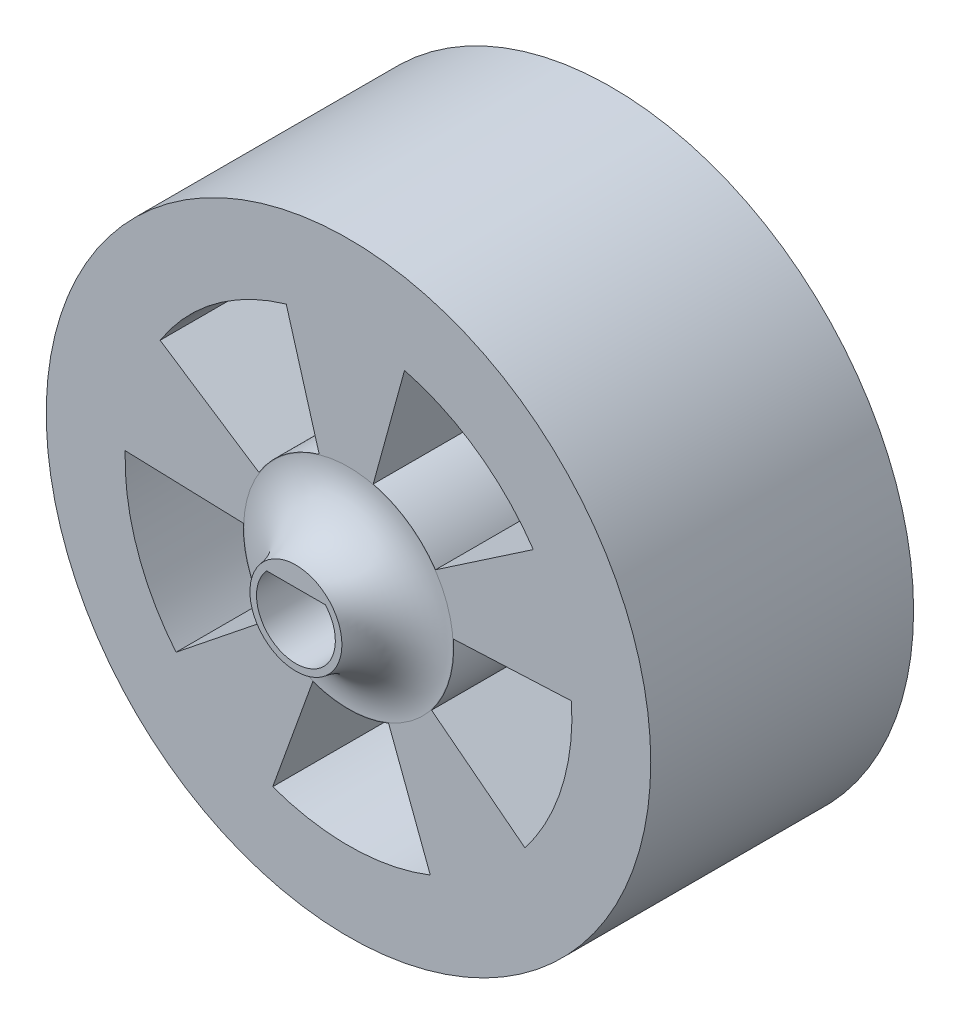
ISO-10303-21;
HEADER;
FILE_DESCRIPTION(('STEP AP214'),'2;1');
FILE_NAME('part.step','',(''),(''),'','','');
FILE_SCHEMA(('AUTOMOTIVE_DESIGN { 1 0 10303 214 1 1 1 1 }'));
ENDSEC;
DATA;
#1=APPLICATION_CONTEXT('core data for automotive mechanical design processes');
#2=APPLICATION_PROTOCOL_DEFINITION('international standard','automotive_design',2000,#1);
#3=PRODUCT_CONTEXT('',#1,'mechanical');
#4=PRODUCT('Part','Part','',(#3));
#5=PRODUCT_RELATED_PRODUCT_CATEGORY('part','',(#4));
#6=PRODUCT_DEFINITION_FORMATION('','',#4);
#7=PRODUCT_DEFINITION_CONTEXT('part definition',#1,'design');
#8=PRODUCT_DEFINITION('design','',#6,#7);
#9=PRODUCT_DEFINITION_SHAPE('','',#8);
#10=(LENGTH_UNIT() NAMED_UNIT(*) SI_UNIT(.MILLI.,.METRE.));
#11=(NAMED_UNIT(*) PLANE_ANGLE_UNIT() SI_UNIT($,.RADIAN.));
#12=(NAMED_UNIT(*) SI_UNIT($,.STERADIAN.) SOLID_ANGLE_UNIT());
#13=UNCERTAINTY_MEASURE_WITH_UNIT(LENGTH_MEASURE(1.E-05),#10,'distance_accuracy_value','');
#14=(GEOMETRIC_REPRESENTATION_CONTEXT(3) GLOBAL_UNCERTAINTY_ASSIGNED_CONTEXT((#13)) GLOBAL_UNIT_ASSIGNED_CONTEXT((#10,
#11,#12)) REPRESENTATION_CONTEXT('',''));
#15=CARTESIAN_POINT('',(0.,0.,0.));
#16=DIRECTION('',(0.,0.,1.));
#17=DIRECTION('',(1.,0.,0.));
#18=AXIS2_PLACEMENT_3D('',#15,#16,#17);
#19=CARTESIAN_POINT('',(0.,0.,0.));
#20=DIRECTION('',(0.,0.,1.));
#21=DIRECTION('',(1.,0.,0.));
#22=AXIS2_PLACEMENT_3D('',#19,#20,#21);
#23=CYLINDRICAL_SURFACE('',#22,8.5);
#24=DIRECTION('',(0.,0.,-1.));
#25=VECTOR('',#24,1.);
#26=CARTESIAN_POINT('',(8.48437143384065,0.515210027686529,10.));
#27=LINE('',#26,#25);
#28=CARTESIAN_POINT('',(8.48437143384065,0.515210027686529,10.));
#29=VERTEX_POINT('',#28);
#30=CARTESIAN_POINT('',(8.48437143384065,0.515210027686529,0.));
#31=VERTEX_POINT('',#30);
#32=EDGE_CURVE('E218',#29,#31,#27,.T.);
#33=ORIENTED_EDGE('',*,*,#32,.T.);
#34=CARTESIAN_POINT('',(0.,0.,0.));
#35=DIRECTION('',(0.,0.,1.));
#36=DIRECTION('',(1.,0.,0.));
#37=AXIS2_PLACEMENT_3D('',#34,#35,#36);
#38=CIRCLE('',#37,8.5);
#39=CARTESIAN_POINT('',(6.71424575052621,-5.21237987885963,0.));
#40=VERTEX_POINT('',#39);
#41=EDGE_CURVE('E405',#40,#31,#38,.T.);
#42=ORIENTED_EDGE('',*,*,#41,.F.);
#43=DIRECTION('',(0.,0.,-1.));
#44=VECTOR('',#43,1.);
#45=CARTESIAN_POINT('',(6.71424575052621,-5.21237987885963,10.));
#46=LINE('',#45,#44);
#47=CARTESIAN_POINT('',(6.71424575052621,-5.21237987885963,10.));
#48=VERTEX_POINT('',#47);
#49=EDGE_CURVE('E237',#48,#40,#46,.T.);
#50=ORIENTED_EDGE('',*,*,#49,.F.);
#51=CARTESIAN_POINT('',(0.,0.,10.));
#52=DIRECTION('',(0.,0.,1.));
#53=DIRECTION('',(1.,0.,0.));
#54=AXIS2_PLACEMENT_3D('',#51,#52,#53);
#55=CIRCLE('',#54,8.5);
#56=EDGE_CURVE('E420',#48,#29,#55,.T.);
#57=ORIENTED_EDGE('',*,*,#56,.T.);
#58=EDGE_LOOP('',(#33,#42,#50,#57));
#59=FACE_BOUND('',#58,.T.);
#60=ADVANCED_FACE('F33',(#59),#23,.F.);
#61=DIRECTION('',(0.,0.,-1.));
#62=VECTOR('',#61,1.);
#63=CARTESIAN_POINT('',(7.03208389051756,4.77491320933936,10.));
#64=LINE('',#63,#62);
#65=CARTESIAN_POINT('',(7.03208389051756,4.77491320933936,10.));
#66=VERTEX_POINT('',#65);
#67=CARTESIAN_POINT('',(7.03208389051755,4.77491320933936,0.));
#68=VERTEX_POINT('',#67);
#69=EDGE_CURVE('E215',#66,#68,#64,.T.);
#70=ORIENTED_EDGE('',*,*,#69,.F.);
#71=CARTESIAN_POINT('',(2.13182110555429,8.22832539305012,10.));
#72=VERTEX_POINT('',#71);
#73=EDGE_CURVE('E321',#66,#72,#55,.T.);
#74=ORIENTED_EDGE('',*,*,#73,.T.);
#75=DIRECTION('',(0.,0.,-1.));
#76=VECTOR('',#75,1.);
#77=CARTESIAN_POINT('',(2.13182110555429,8.22832539305012,10.));
#78=LINE('',#77,#76);
#79=CARTESIAN_POINT('',(2.13182110555429,8.22832539305012,0.));
#80=VERTEX_POINT('',#79);
#81=EDGE_CURVE('E315',#72,#80,#78,.T.);
#82=ORIENTED_EDGE('',*,*,#81,.T.);
#83=EDGE_CURVE('E327',#68,#80,#38,.T.);
#84=ORIENTED_EDGE('',*,*,#83,.F.);
#85=EDGE_LOOP('',(#70,#74,#82,#84));
#86=FACE_BOUND('',#85,.T.);
#87=ADVANCED_FACE('F356',(#86),#23,.F.);
#88=CARTESIAN_POINT('',(0.,0.,10.));
#89=DIRECTION('',(0.,0.,-1.));
#90=DIRECTION('',(-1.,0.,0.));
#91=AXIS2_PLACEMENT_3D('',#88,#89,#90);
#92=CYLINDRICAL_SURFACE('',#91,4.);
#93=DIRECTION('',(0.,0.,-1.));
#94=VECTOR('',#93,1.);
#95=CARTESIAN_POINT('',(3.98819234617977,0.307118559961968,10.));
#96=LINE('',#95,#94);
#97=CARTESIAN_POINT('',(3.98819234617977,0.307118559961968,10.));
#98=VERTEX_POINT('',#97);
#99=CARTESIAN_POINT('',(3.98819234617977,0.307118559961968,0.));
#100=VERTEX_POINT('',#99);
#101=EDGE_CURVE('E221',#98,#100,#96,.T.);
#102=ORIENTED_EDGE('',*,*,#101,.F.);
#103=CARTESIAN_POINT('',(0.,0.,10.));
#104=DIRECTION('',(0.,0.,1.));
#105=DIRECTION('',(1.,0.,0.));
#106=AXIS2_PLACEMENT_3D('',#103,#104,#105);
#107=CIRCLE('',#106,4.);
#108=CARTESIAN_POINT('',(3.15964505907116,-2.45288464887512,10.));
#109=VERTEX_POINT('',#108);
#110=EDGE_CURVE('E439',#109,#98,#107,.T.);
#111=ORIENTED_EDGE('',*,*,#110,.F.);
#112=DIRECTION('',(0.,0.,-1.));
#113=VECTOR('',#112,1.);
#114=CARTESIAN_POINT('',(3.15964505907116,-2.45288464887512,10.));
#115=LINE('',#114,#113);
#116=CARTESIAN_POINT('',(3.15964505907116,-2.45288464887512,0.));
#117=VERTEX_POINT('',#116);
#118=EDGE_CURVE('E231',#109,#117,#115,.T.);
#119=ORIENTED_EDGE('',*,*,#118,.T.);
#120=CARTESIAN_POINT('',(0.,0.,0.));
#121=DIRECTION('',(0.,0.,1.));
#122=DIRECTION('',(1.,0.,0.));
#123=AXIS2_PLACEMENT_3D('',#120,#121,#122);
#124=CIRCLE('',#123,4.);
#125=EDGE_CURVE('E423',#117,#100,#124,.T.);
#126=ORIENTED_EDGE('',*,*,#125,.T.);
#127=EDGE_LOOP('',(#102,#111,#119,#126));
#128=FACE_BOUND('',#127,.T.);
#129=ADVANCED_FACE('F363',(#128),#92,.T.);
#130=DIRECTION('',(0.,0.,-1.));
#131=VECTOR('',#130,1.);
#132=CARTESIAN_POINT('',(3.30921594847885,2.24701798086558,10.));
#133=LINE('',#132,#131);
#134=CARTESIAN_POINT('',(3.30921594847885,2.24701798086558,10.));
#135=VERTEX_POINT('',#134);
#136=CARTESIAN_POINT('',(3.30921594847885,2.24701798086558,0.));
#137=VERTEX_POINT('',#136);
#138=EDGE_CURVE('E209',#135,#137,#133,.T.);
#139=ORIENTED_EDGE('',*,*,#138,.T.);
#140=CARTESIAN_POINT('',(0.940332104078659,3.88790117338893,0.));
#141=VERTEX_POINT('',#140);
#142=EDGE_CURVE('E290',#137,#141,#124,.T.);
#143=ORIENTED_EDGE('',*,*,#142,.T.);
#144=DIRECTION('',(0.,0.,-1.));
#145=VECTOR('',#144,1.);
#146=CARTESIAN_POINT('',(0.940332104078659,3.88790117338893,10.));
#147=LINE('',#146,#145);
#148=CARTESIAN_POINT('',(0.940332104078659,3.88790117338893,10.));
#149=VERTEX_POINT('',#148);
#150=EDGE_CURVE('E318',#149,#141,#147,.T.);
#151=ORIENTED_EDGE('',*,*,#150,.F.);
#152=EDGE_CURVE('E296',#135,#149,#107,.T.);
#153=ORIENTED_EDGE('',*,*,#152,.F.);
#154=EDGE_LOOP('',(#139,#143,#151,#153));
#155=FACE_BOUND('',#154,.T.);
#156=ADVANCED_FACE('F385',(#155),#92,.T.);
#157=DIRECTION('',(0.,0.,-1.));
#158=VECTOR('',#157,1.);
#159=CARTESIAN_POINT('',(3.11180881373797,-7.90990808459509,10.));
#160=LINE('',#159,#158);
#161=CARTESIAN_POINT('',(3.11180881373797,-7.90990808459509,10.));
#162=VERTEX_POINT('',#161);
#163=CARTESIAN_POINT('',(3.11180881373797,-7.90990808459509,0.));
#164=VERTEX_POINT('',#163);
#165=EDGE_CURVE('E240',#162,#164,#160,.T.);
#166=ORIENTED_EDGE('',*,*,#165,.T.);
#167=CARTESIAN_POINT('',(-2.88245180787283,-7.99634113675065,0.));
#168=VERTEX_POINT('',#167);
#169=EDGE_CURVE('E397',#168,#164,#38,.T.);
#170=ORIENTED_EDGE('',*,*,#169,.F.);
#171=DIRECTION('',(0.,0.,-1.));
#172=VECTOR('',#171,1.);
#173=CARTESIAN_POINT('',(-2.88245180787283,-7.99634113675065,10.));
#174=LINE('',#173,#172);
#175=CARTESIAN_POINT('',(-2.88245180787283,-7.99634113675065,10.));
#176=VERTEX_POINT('',#175);
#177=EDGE_CURVE('E259',#176,#168,#174,.T.);
#178=ORIENTED_EDGE('',*,*,#177,.F.);
#179=EDGE_CURVE('E399',#176,#162,#55,.T.);
#180=ORIENTED_EDGE('',*,*,#179,.T.);
#181=EDGE_LOOP('',(#166,#170,#178,#180));
#182=FACE_BOUND('',#181,.T.);
#183=ADVANCED_FACE('F365',(#182),#23,.F.);
#184=DIRECTION('',(0.,0.,-1.));
#185=VECTOR('',#184,1.);
#186=CARTESIAN_POINT('',(1.52450631953265,-3.69809146475652,10.));
#187=LINE('',#186,#185);
#188=CARTESIAN_POINT('',(1.52450631953265,-3.69809146475652,10.));
#189=VERTEX_POINT('',#188);
#190=CARTESIAN_POINT('',(1.52450631953265,-3.69809146475652,0.));
#191=VERTEX_POINT('',#190);
#192=EDGE_CURVE('E243',#189,#191,#187,.T.);
#193=ORIENTED_EDGE('',*,*,#192,.F.);
#194=CARTESIAN_POINT('',(-1.35644790958722,-3.76298406435325,10.));
#195=VERTEX_POINT('',#194);
#196=EDGE_CURVE('E437',#195,#189,#107,.T.);
#197=ORIENTED_EDGE('',*,*,#196,.F.);
#198=DIRECTION('',(0.,0.,-1.));
#199=VECTOR('',#198,1.);
#200=CARTESIAN_POINT('',(-1.35644790958722,-3.76298406435325,10.));
#201=LINE('',#200,#199);
#202=CARTESIAN_POINT('',(-1.35644790958722,-3.76298406435325,0.));
#203=VERTEX_POINT('',#202);
#204=EDGE_CURVE('E253',#195,#203,#201,.T.);
#205=ORIENTED_EDGE('',*,*,#204,.T.);
#206=EDGE_CURVE('E424',#203,#191,#124,.T.);
#207=ORIENTED_EDGE('',*,*,#206,.T.);
#208=EDGE_LOOP('',(#193,#197,#205,#207));
#209=FACE_BOUND('',#208,.T.);
#210=ADVANCED_FACE('F378',(#209),#92,.T.);
#211=DIRECTION('',(0.,0.,-1.));
#212=VECTOR('',#211,1.);
#213=CARTESIAN_POINT('',(-6.56116782045911,-5.40380207185384,10.));
#214=LINE('',#213,#212);
#215=CARTESIAN_POINT('',(-6.56116782045911,-5.40380207185384,10.));
#216=VERTEX_POINT('',#215);
#217=CARTESIAN_POINT('',(-6.56116782045911,-5.40380207185384,0.));
#218=VERTEX_POINT('',#217);
#219=EDGE_CURVE('E262',#216,#218,#214,.T.);
#220=ORIENTED_EDGE('',*,*,#219,.T.);
#221=CARTESIAN_POINT('',(-8.4956989387252,0.270369270708785,0.));
#222=VERTEX_POINT('',#221);
#223=EDGE_CURVE('E326',#222,#218,#38,.T.);
#224=ORIENTED_EDGE('',*,*,#223,.F.);
#225=DIRECTION('',(0.,0.,-1.));
#226=VECTOR('',#225,1.);
#227=CARTESIAN_POINT('',(-8.4956989387252,0.270369270708786,10.));
#228=LINE('',#227,#226);
#229=CARTESIAN_POINT('',(-8.4956989387252,0.270369270708786,10.));
#230=VERTEX_POINT('',#229);
#231=EDGE_CURVE('E281',#230,#222,#228,.T.);
#232=ORIENTED_EDGE('',*,*,#231,.F.);
#233=EDGE_CURVE('E331',#230,#216,#55,.T.);
#234=ORIENTED_EDGE('',*,*,#233,.T.);
#235=EDGE_LOOP('',(#220,#224,#232,#234));
#236=FACE_BOUND('',#235,.T.);
#237=ADVANCED_FACE('F370',(#236),#23,.F.);
#238=DIRECTION('',(0.,0.,-1.));
#239=VECTOR('',#238,1.);
#240=CARTESIAN_POINT('',(-3.04599562464459,-2.59266477868737,10.));
#241=LINE('',#240,#239);
#242=CARTESIAN_POINT('',(-3.04599562464459,-2.59266477868737,10.));
#243=VERTEX_POINT('',#242);
#244=CARTESIAN_POINT('',(-3.04599562464459,-2.59266477868737,0.));
#245=VERTEX_POINT('',#244);
#246=EDGE_CURVE('E265',#243,#245,#241,.T.);
#247=ORIENTED_EDGE('',*,*,#246,.F.);
#248=CARTESIAN_POINT('',(-3.9979759711648,0.127232597980605,10.));
#249=VERTEX_POINT('',#248);
#250=EDGE_CURVE('E295',#249,#243,#107,.T.);
#251=ORIENTED_EDGE('',*,*,#250,.F.);
#252=DIRECTION('',(0.,0.,-1.));
#253=VECTOR('',#252,1.);
#254=CARTESIAN_POINT('',(-3.9979759711648,0.127232597980605,10.));
#255=LINE('',#254,#253);
#256=CARTESIAN_POINT('',(-3.9979759711648,0.127232597980605,0.));
#257=VERTEX_POINT('',#256);
#258=EDGE_CURVE('E275',#249,#257,#255,.T.);
#259=ORIENTED_EDGE('',*,*,#258,.T.);
#260=EDGE_CURVE('E299',#257,#245,#124,.T.);
#261=ORIENTED_EDGE('',*,*,#260,.T.);
#262=EDGE_LOOP('',(#247,#251,#259,#261));
#263=FACE_BOUND('',#262,.T.);
#264=ADVANCED_FACE('F368',(#263),#92,.T.);
#265=DIRECTION('',(0.,0.,-1.));
#266=VECTOR('',#265,1.);
#267=CARTESIAN_POINT('',(-7.16683353267374,4.57017473571233,10.));
#268=LINE('',#267,#266);
#269=CARTESIAN_POINT('',(-7.16683353267374,4.57017473571233,10.));
#270=VERTEX_POINT('',#269);
#271=CARTESIAN_POINT('',(-7.16683353267374,4.57017473571233,0.));
#272=VERTEX_POINT('',#271);
#273=EDGE_CURVE('E284',#270,#272,#268,.T.);
#274=ORIENTED_EDGE('',*,*,#273,.T.);
#275=CARTESIAN_POINT('',(-2.36817889444572,8.1634385355622,0.));
#276=VERTEX_POINT('',#275);
#277=EDGE_CURVE('E322',#276,#272,#38,.T.);
#278=ORIENTED_EDGE('',*,*,#277,.F.);
#279=DIRECTION('',(0.,0.,-1.));
#280=VECTOR('',#279,1.);
#281=CARTESIAN_POINT('',(-2.36817889444572,8.1634385355622,10.));
#282=LINE('',#281,#280);
#283=CARTESIAN_POINT('',(-2.36817889444572,8.1634385355622,10.));
#284=VERTEX_POINT('',#283);
#285=EDGE_CURVE('E312',#284,#276,#282,.T.);
#286=ORIENTED_EDGE('',*,*,#285,.F.);
#287=EDGE_CURVE('E328',#284,#270,#55,.T.);
#288=ORIENTED_EDGE('',*,*,#287,.T.);
#289=EDGE_LOOP('',(#274,#278,#286,#288));
#290=FACE_BOUND('',#289,.T.);
#291=ADVANCED_FACE('F359',(#290),#23,.F.);
#292=DIRECTION('',(0.,0.,-1.));
#293=VECTOR('',#292,1.);
#294=CARTESIAN_POINT('',(-3.40703514514646,2.09573651009301,10.));
#295=LINE('',#294,#293);
#296=CARTESIAN_POINT('',(-3.40703514514646,2.09573651009301,10.));
#297=VERTEX_POINT('',#296);
#298=CARTESIAN_POINT('',(-3.40703514514646,2.09573651009301,0.));
#299=VERTEX_POINT('',#298);
#300=EDGE_CURVE('E287',#297,#299,#295,.T.);
#301=ORIENTED_EDGE('',*,*,#300,.F.);
#302=CARTESIAN_POINT('',(-1.11443712679798,3.84161813438221,10.));
#303=VERTEX_POINT('',#302);
#304=EDGE_CURVE('E291',#303,#297,#107,.T.);
#305=ORIENTED_EDGE('',*,*,#304,.F.);
#306=DIRECTION('',(0.,0.,-1.));
#307=VECTOR('',#306,1.);
#308=CARTESIAN_POINT('',(-1.11443712679798,3.84161813438221,10.));
#309=LINE('',#308,#307);
#310=CARTESIAN_POINT('',(-1.11443712679798,3.84161813438221,0.));
#311=VERTEX_POINT('',#310);
#312=EDGE_CURVE('E306',#303,#311,#309,.T.);
#313=ORIENTED_EDGE('',*,*,#312,.T.);
#314=EDGE_CURVE('E297',#311,#299,#124,.T.);
#315=ORIENTED_EDGE('',*,*,#314,.T.);
#316=EDGE_LOOP('',(#301,#305,#313,#315));
#317=FACE_BOUND('',#316,.T.);
#318=ADVANCED_FACE('F367',(#317),#92,.T.);
#319=CARTESIAN_POINT('',(0.,0.,10.));
#320=DIRECTION('',(0.,0.,-1.));
#321=DIRECTION('',(-1.,0.,0.));
#322=AXIS2_PLACEMENT_3D('',#319,#320,#321);
#323=CYLINDRICAL_SURFACE('',#322,11.5);
#324=CARTESIAN_POINT('',(0.,0.,10.));
#325=DIRECTION('',(0.,0.,1.));
#326=DIRECTION('',(1.,0.,0.));
#327=AXIS2_PLACEMENT_3D('',#324,#325,#326);
#328=CIRCLE('',#327,11.5);
#329=CARTESIAN_POINT('',(11.5,0.,10.));
#330=VERTEX_POINT('',#329);
#331=EDGE_CURVE('E41',#330,#330,#328,.T.);
#332=ORIENTED_EDGE('',*,*,#331,.F.);
#333=EDGE_LOOP('',(#332));
#334=FACE_BOUND('',#333,.T.);
#335=CARTESIAN_POINT('',(0.,0.,0.));
#336=DIRECTION('',(0.,0.,1.));
#337=DIRECTION('',(1.,0.,0.));
#338=AXIS2_PLACEMENT_3D('',#335,#336,#337);
#339=CIRCLE('',#338,11.5);
#340=CARTESIAN_POINT('',(11.5,0.,0.));
#341=VERTEX_POINT('',#340);
#342=EDGE_CURVE('E325',#341,#341,#339,.T.);
#343=ORIENTED_EDGE('',*,*,#342,.T.);
#344=EDGE_LOOP('',(#343));
#345=FACE_BOUND('',#344,.T.);
#346=ADVANCED_FACE('F336',(#334,#345),#323,.T.);
#347=CARTESIAN_POINT('',(0.,0.,10.));
#348=DIRECTION('',(0.,0.,1.));
#349=DIRECTION('',(1.,0.,0.));
#350=AXIS2_PLACEMENT_3D('',#347,#348,#349);
#351=PLANE('',#350);
#352=CARTESIAN_POINT('',(0.,0.,10.));
#353=DIRECTION('',(0.,0.,1.));
#354=DIRECTION('',(1.,0.,0.));
#355=AXIS2_PLACEMENT_3D('',#352,#353,#354);
#356=CIRCLE('',#355,3.98606797749979);
#357=CARTESIAN_POINT('',(3.98606797749979,0.,10.));
#358=VERTEX_POINT('',#357);
#359=EDGE_CURVE('E11',#358,#358,#356,.F.);
#360=ORIENTED_EDGE('',*,*,#359,.T.);
#361=EDGE_LOOP('',(#360));
#362=FACE_BOUND('',#361,.T.);
#363=ORIENTED_EDGE('',*,*,#110,.T.);
#364=DIRECTION('',(0.998930712880404,0.0462323573295585,0.));
#365=VECTOR('',#364,1.);
#366=CARTESIAN_POINT('',(3.98819234617977,0.307118559961968,10.));
#367=LINE('',#366,#365);
#368=EDGE_CURVE('E203',#98,#29,#367,.T.);
#369=ORIENTED_EDGE('',*,*,#368,.T.);
#370=ORIENTED_EDGE('',*,*,#56,.F.);
#371=DIRECTION('',(-0.78991126476779,0.61322116221878,0.));
#372=VECTOR('',#371,1.);
#373=CARTESIAN_POINT('',(3.15964505907116,-2.45288464887512,10.));
#374=LINE('',#373,#372);
#375=EDGE_CURVE('E227',#48,#109,#374,.T.);
#376=ORIENTED_EDGE('',*,*,#375,.T.);
#377=EDGE_LOOP('',(#363,#369,#370,#376));
#378=FACE_BOUND('',#377,.T.);
#379=ORIENTED_EDGE('',*,*,#196,.T.);
#380=DIRECTION('',(0.352656151185087,-0.935752979707423,0.));
#381=VECTOR('',#380,1.);
#382=CARTESIAN_POINT('',(1.52450631953265,-3.69809146475652,10.));
#383=LINE('',#382,#381);
#384=EDGE_CURVE('E225',#189,#162,#383,.T.);
#385=ORIENTED_EDGE('',*,*,#384,.T.);
#386=ORIENTED_EDGE('',*,*,#179,.F.);
#387=DIRECTION('',(0.339111977396804,0.940746016088311,0.));
#388=VECTOR('',#387,1.);
#389=CARTESIAN_POINT('',(-1.35644790958722,-3.76298406435325,10.));
#390=LINE('',#389,#388);
#391=EDGE_CURVE('E249',#176,#195,#390,.T.);
#392=ORIENTED_EDGE('',*,*,#391,.T.);
#393=EDGE_LOOP('',(#379,#385,#386,#392));
#394=FACE_BOUND('',#393,.T.);
#395=ORIENTED_EDGE('',*,*,#250,.T.);
#396=DIRECTION('',(-0.7809772251063,-0.624559503862733,0.));
#397=VECTOR('',#396,1.);
#398=CARTESIAN_POINT('',(-3.04599562464459,-2.59266477868737,10.));
#399=LINE('',#398,#397);
#400=EDGE_CURVE('E247',#243,#216,#399,.T.);
#401=ORIENTED_EDGE('',*,*,#400,.T.);
#402=ORIENTED_EDGE('',*,*,#233,.F.);
#403=DIRECTION('',(0.999493992791199,-0.0318081494951512,0.));
#404=VECTOR('',#403,1.);
#405=CARTESIAN_POINT('',(-3.9979759711648,0.127232597980605,10.));
#406=LINE('',#405,#404);
#407=EDGE_CURVE('E271',#230,#249,#406,.T.);
#408=ORIENTED_EDGE('',*,*,#407,.T.);
#409=EDGE_LOOP('',(#395,#401,#402,#408));
#410=FACE_BOUND('',#409,.T.);
#411=DIRECTION('',(-0.827303987119713,-0.561754495216395,0.));
#412=VECTOR('',#411,1.);
#413=CARTESIAN_POINT('',(3.30921594847885,2.24701798086558,10.));
#414=LINE('',#413,#412);
#415=EDGE_CURVE('E205',#66,#135,#414,.T.);
#416=ORIENTED_EDGE('',*,*,#415,.T.);
#417=ORIENTED_EDGE('',*,*,#152,.T.);
#418=DIRECTION('',(0.264716981781171,0.964326147917118,0.));
#419=VECTOR('',#418,1.);
#420=CARTESIAN_POINT('',(0.940332104078659,3.88790117338893,10.));
#421=LINE('',#420,#419);
#422=EDGE_CURVE('E300',#149,#72,#421,.T.);
#423=ORIENTED_EDGE('',*,*,#422,.T.);
#424=ORIENTED_EDGE('',*,*,#73,.F.);
#425=EDGE_LOOP('',(#416,#417,#423,#424));
#426=FACE_BOUND('',#425,.T.);
#427=ORIENTED_EDGE('',*,*,#287,.F.);
#428=DIRECTION('',(0.278609281699496,-0.960404533595553,0.));
#429=VECTOR('',#428,1.);
#430=CARTESIAN_POINT('',(-1.11443712679798,3.84161813438221,10.));
#431=LINE('',#430,#429);
#432=EDGE_CURVE('E303',#284,#303,#431,.T.);
#433=ORIENTED_EDGE('',*,*,#432,.T.);
#434=ORIENTED_EDGE('',*,*,#304,.T.);
#435=DIRECTION('',(-0.835326620740355,0.549753978323485,0.));
#436=VECTOR('',#435,1.);
#437=CARTESIAN_POINT('',(-3.40703514514646,2.09573651009301,10.));
#438=LINE('',#437,#436);
#439=EDGE_CURVE('E269',#297,#270,#438,.T.);
#440=ORIENTED_EDGE('',*,*,#439,.T.);
#441=EDGE_LOOP('',(#427,#433,#434,#440));
#442=FACE_BOUND('',#441,.T.);
#443=ORIENTED_EDGE('',*,*,#331,.T.);
#444=EDGE_LOOP('',(#443));
#445=FACE_BOUND('',#444,.T.);
#446=ADVANCED_FACE('F341',(#362,#378,#394,#410,#426,#442,#445),#351,.T.);
#447=CARTESIAN_POINT('',(0.,0.,0.));
#448=DIRECTION('',(0.,0.,1.));
#449=DIRECTION('',(1.,0.,0.));
#450=AXIS2_PLACEMENT_3D('',#447,#448,#449);
#451=PLANE('',#450);
#452=DIRECTION('',(-1.,0.,0.));
#453=VECTOR('',#452,1.);
#454=CARTESIAN_POINT('',(-1.11803398874989,1.,0.));
#455=LINE('',#454,#453);
#456=CARTESIAN_POINT('',(1.11803398874989,1.,0.));
#457=VERTEX_POINT('',#456);
#458=CARTESIAN_POINT('',(-1.11803398874989,1.,0.));
#459=VERTEX_POINT('',#458);
#460=EDGE_CURVE('E200',#457,#459,#455,.T.);
#461=ORIENTED_EDGE('',*,*,#460,.T.);
#462=CARTESIAN_POINT('',(0.,0.,0.));
#463=DIRECTION('',(0.,0.,1.));
#464=DIRECTION('',(1.,0.,0.));
#465=AXIS2_PLACEMENT_3D('',#462,#463,#464);
#466=CIRCLE('',#465,1.5);
#467=EDGE_CURVE('E55',#459,#457,#466,.T.);
#468=ORIENTED_EDGE('',*,*,#467,.T.);
#469=EDGE_LOOP('',(#461,#468));
#470=FACE_BOUND('',#469,.T.);
#471=DIRECTION('',(0.998930712880404,0.0462323573295585,0.));
#472=VECTOR('',#471,1.);
#473=CARTESIAN_POINT('',(3.98819234617977,0.307118559961968,0.));
#474=LINE('',#473,#472);
#475=EDGE_CURVE('E186',#100,#31,#474,.T.);
#476=ORIENTED_EDGE('',*,*,#475,.F.);
#477=ORIENTED_EDGE('',*,*,#125,.F.);
#478=DIRECTION('',(-0.78991126476779,0.61322116221878,0.));
#479=VECTOR('',#478,1.);
#480=CARTESIAN_POINT('',(3.15964505907116,-2.45288464887512,0.));
#481=LINE('',#480,#479);
#482=EDGE_CURVE('E228',#40,#117,#481,.T.);
#483=ORIENTED_EDGE('',*,*,#482,.F.);
#484=ORIENTED_EDGE('',*,*,#41,.T.);
#485=EDGE_LOOP('',(#476,#477,#483,#484));
#486=FACE_BOUND('',#485,.T.);
#487=DIRECTION('',(0.352656151185087,-0.935752979707423,0.));
#488=VECTOR('',#487,1.);
#489=CARTESIAN_POINT('',(1.52450631953265,-3.69809146475652,0.));
#490=LINE('',#489,#488);
#491=EDGE_CURVE('E224',#191,#164,#490,.T.);
#492=ORIENTED_EDGE('',*,*,#491,.F.);
#493=ORIENTED_EDGE('',*,*,#206,.F.);
#494=DIRECTION('',(0.339111977396804,0.940746016088311,0.));
#495=VECTOR('',#494,1.);
#496=CARTESIAN_POINT('',(-1.35644790958722,-3.76298406435325,0.));
#497=LINE('',#496,#495);
#498=EDGE_CURVE('E250',#168,#203,#497,.T.);
#499=ORIENTED_EDGE('',*,*,#498,.F.);
#500=ORIENTED_EDGE('',*,*,#169,.T.);
#501=EDGE_LOOP('',(#492,#493,#499,#500));
#502=FACE_BOUND('',#501,.T.);
#503=DIRECTION('',(-0.7809772251063,-0.624559503862733,0.));
#504=VECTOR('',#503,1.);
#505=CARTESIAN_POINT('',(-3.04599562464459,-2.59266477868737,0.));
#506=LINE('',#505,#504);
#507=EDGE_CURVE('E246',#245,#218,#506,.T.);
#508=ORIENTED_EDGE('',*,*,#507,.F.);
#509=ORIENTED_EDGE('',*,*,#260,.F.);
#510=DIRECTION('',(0.999493992791199,-0.0318081494951512,0.));
#511=VECTOR('',#510,1.);
#512=CARTESIAN_POINT('',(-3.9979759711648,0.127232597980605,0.));
#513=LINE('',#512,#511);
#514=EDGE_CURVE('E272',#222,#257,#513,.T.);
#515=ORIENTED_EDGE('',*,*,#514,.F.);
#516=ORIENTED_EDGE('',*,*,#223,.T.);
#517=EDGE_LOOP('',(#508,#509,#515,#516));
#518=FACE_BOUND('',#517,.T.);
#519=ORIENTED_EDGE('',*,*,#142,.F.);
#520=DIRECTION('',(-0.827303987119713,-0.561754495216395,0.));
#521=VECTOR('',#520,1.);
#522=CARTESIAN_POINT('',(3.30921594847885,2.24701798086558,0.));
#523=LINE('',#522,#521);
#524=EDGE_CURVE('E206',#68,#137,#523,.T.);
#525=ORIENTED_EDGE('',*,*,#524,.F.);
#526=ORIENTED_EDGE('',*,*,#83,.T.);
#527=DIRECTION('',(0.264716981781171,0.964326147917118,0.));
#528=VECTOR('',#527,1.);
#529=CARTESIAN_POINT('',(0.940332104078659,3.88790117338893,0.));
#530=LINE('',#529,#528);
#531=EDGE_CURVE('E294',#141,#80,#530,.T.);
#532=ORIENTED_EDGE('',*,*,#531,.F.);
#533=EDGE_LOOP('',(#519,#525,#526,#532));
#534=FACE_BOUND('',#533,.T.);
#535=ORIENTED_EDGE('',*,*,#277,.T.);
#536=DIRECTION('',(-0.835326620740355,0.549753978323485,0.));
#537=VECTOR('',#536,1.);
#538=CARTESIAN_POINT('',(-3.40703514514646,2.09573651009301,0.));
#539=LINE('',#538,#537);
#540=EDGE_CURVE('E268',#299,#272,#539,.T.);
#541=ORIENTED_EDGE('',*,*,#540,.F.);
#542=ORIENTED_EDGE('',*,*,#314,.F.);
#543=DIRECTION('',(0.278609281699496,-0.960404533595553,0.));
#544=VECTOR('',#543,1.);
#545=CARTESIAN_POINT('',(-1.11443712679798,3.84161813438221,0.));
#546=LINE('',#545,#544);
#547=EDGE_CURVE('E304',#276,#311,#546,.T.);
#548=ORIENTED_EDGE('',*,*,#547,.F.);
#549=EDGE_LOOP('',(#535,#541,#542,#548));
#550=FACE_BOUND('',#549,.T.);
#551=ORIENTED_EDGE('',*,*,#342,.F.);
#552=EDGE_LOOP('',(#551));
#553=FACE_BOUND('',#552,.T.);
#554=ADVANCED_FACE('F338',(#470,#486,#502,#518,#534,#550,#553),#451,.F.);
#555=CARTESIAN_POINT('',(0.940332104078659,3.88790117338893,10.));
#556=DIRECTION('',(-0.964326147917118,0.264716981781171,0.));
#557=DIRECTION('',(-0.264716981781171,-0.964326147917118,0.));
#558=AXIS2_PLACEMENT_3D('',#555,#556,#557);
#559=PLANE('',#558);
#560=ORIENTED_EDGE('',*,*,#531,.T.);
#561=ORIENTED_EDGE('',*,*,#81,.F.);
#562=ORIENTED_EDGE('',*,*,#422,.F.);
#563=ORIENTED_EDGE('',*,*,#150,.T.);
#564=EDGE_LOOP('',(#560,#561,#562,#563));
#565=FACE_BOUND('',#564,.T.);
#566=ADVANCED_FACE('F340',(#565),#559,.F.);
#567=CARTESIAN_POINT('',(-1.11443712679798,3.84161813438221,10.));
#568=DIRECTION('',(0.960404533595553,0.278609281699496,0.));
#569=DIRECTION('',(-0.278609281699496,0.960404533595553,0.));
#570=AXIS2_PLACEMENT_3D('',#567,#568,#569);
#571=PLANE('',#570);
#572=ORIENTED_EDGE('',*,*,#547,.T.);
#573=ORIENTED_EDGE('',*,*,#312,.F.);
#574=ORIENTED_EDGE('',*,*,#432,.F.);
#575=ORIENTED_EDGE('',*,*,#285,.T.);
#576=EDGE_LOOP('',(#572,#573,#574,#575));
#577=FACE_BOUND('',#576,.T.);
#578=ADVANCED_FACE('F348',(#577),#571,.F.);
#579=CARTESIAN_POINT('',(-3.40703514514646,2.09573651009301,10.));
#580=DIRECTION('',(-0.549753978323485,-0.835326620740355,0.));
#581=DIRECTION('',(0.835326620740355,-0.549753978323485,0.));
#582=AXIS2_PLACEMENT_3D('',#579,#580,#581);
#583=PLANE('',#582);
#584=ORIENTED_EDGE('',*,*,#540,.T.);
#585=ORIENTED_EDGE('',*,*,#273,.F.);
#586=ORIENTED_EDGE('',*,*,#439,.F.);
#587=ORIENTED_EDGE('',*,*,#300,.T.);
#588=EDGE_LOOP('',(#584,#585,#586,#587));
#589=FACE_BOUND('',#588,.T.);
#590=ADVANCED_FACE('F455',(#589),#583,.F.);
#591=CARTESIAN_POINT('',(-3.9979759711648,0.127232597980605,10.));
#592=DIRECTION('',(0.0318081494951512,0.9994939927912,0.));
#593=DIRECTION('',(-0.9994939927912,0.0318081494951512,0.));
#594=AXIS2_PLACEMENT_3D('',#591,#592,#593);
#595=PLANE('',#594);
#596=ORIENTED_EDGE('',*,*,#514,.T.);
#597=ORIENTED_EDGE('',*,*,#258,.F.);
#598=ORIENTED_EDGE('',*,*,#407,.F.);
#599=ORIENTED_EDGE('',*,*,#231,.T.);
#600=EDGE_LOOP('',(#596,#597,#598,#599));
#601=FACE_BOUND('',#600,.T.);
#602=ADVANCED_FACE('F453',(#601),#595,.F.);
#603=CARTESIAN_POINT('',(-3.04599562464459,-2.59266477868737,10.));
#604=DIRECTION('',(0.624559503862733,-0.7809772251063,0.));
#605=DIRECTION('',(0.7809772251063,0.624559503862733,0.));
#606=AXIS2_PLACEMENT_3D('',#603,#604,#605);
#607=PLANE('',#606);
#608=ORIENTED_EDGE('',*,*,#507,.T.);
#609=ORIENTED_EDGE('',*,*,#219,.F.);
#610=ORIENTED_EDGE('',*,*,#400,.F.);
#611=ORIENTED_EDGE('',*,*,#246,.T.);
#612=EDGE_LOOP('',(#608,#609,#610,#611));
#613=FACE_BOUND('',#612,.T.);
#614=ADVANCED_FACE('F433',(#613),#607,.F.);
#615=CARTESIAN_POINT('',(-1.35644790958722,-3.76298406435325,10.));
#616=DIRECTION('',(-0.940746016088312,0.339111977396804,0.));
#617=DIRECTION('',(-0.339111977396804,-0.940746016088312,0.));
#618=AXIS2_PLACEMENT_3D('',#615,#616,#617);
#619=PLANE('',#618);
#620=ORIENTED_EDGE('',*,*,#498,.T.);
#621=ORIENTED_EDGE('',*,*,#204,.F.);
#622=ORIENTED_EDGE('',*,*,#391,.F.);
#623=ORIENTED_EDGE('',*,*,#177,.T.);
#624=EDGE_LOOP('',(#620,#621,#622,#623));
#625=FACE_BOUND('',#624,.T.);
#626=ADVANCED_FACE('F461',(#625),#619,.F.);
#627=CARTESIAN_POINT('',(1.52450631953265,-3.69809146475652,10.));
#628=DIRECTION('',(0.935752979707423,0.352656151185087,0.));
#629=DIRECTION('',(-0.352656151185087,0.935752979707423,0.));
#630=AXIS2_PLACEMENT_3D('',#627,#628,#629);
#631=PLANE('',#630);
#632=ORIENTED_EDGE('',*,*,#491,.T.);
#633=ORIENTED_EDGE('',*,*,#165,.F.);
#634=ORIENTED_EDGE('',*,*,#384,.F.);
#635=ORIENTED_EDGE('',*,*,#192,.T.);
#636=EDGE_LOOP('',(#632,#633,#634,#635));
#637=FACE_BOUND('',#636,.T.);
#638=ADVANCED_FACE('F543',(#637),#631,.F.);
#639=CARTESIAN_POINT('',(3.15964505907116,-2.45288464887512,10.));
#640=DIRECTION('',(-0.61322116221878,-0.78991126476779,0.));
#641=DIRECTION('',(0.78991126476779,-0.61322116221878,0.));
#642=AXIS2_PLACEMENT_3D('',#639,#640,#641);
#643=PLANE('',#642);
#644=ORIENTED_EDGE('',*,*,#482,.T.);
#645=ORIENTED_EDGE('',*,*,#118,.F.);
#646=ORIENTED_EDGE('',*,*,#375,.F.);
#647=ORIENTED_EDGE('',*,*,#49,.T.);
#648=EDGE_LOOP('',(#644,#645,#646,#647));
#649=FACE_BOUND('',#648,.T.);
#650=ADVANCED_FACE('F536',(#649),#643,.F.);
#651=CARTESIAN_POINT('',(3.98819234617977,0.307118559961968,10.));
#652=DIRECTION('',(-0.0462323573295585,0.998930712880404,0.));
#653=DIRECTION('',(-0.998930712880404,-0.0462323573295585,0.));
#654=AXIS2_PLACEMENT_3D('',#651,#652,#653);
#655=PLANE('',#654);
#656=ORIENTED_EDGE('',*,*,#475,.T.);
#657=ORIENTED_EDGE('',*,*,#32,.F.);
#658=ORIENTED_EDGE('',*,*,#368,.F.);
#659=ORIENTED_EDGE('',*,*,#101,.T.);
#660=EDGE_LOOP('',(#656,#657,#658,#659));
#661=FACE_BOUND('',#660,.T.);
#662=ADVANCED_FACE('F448',(#661),#655,.F.);
#663=CARTESIAN_POINT('',(3.30921594847885,2.24701798086558,10.));
#664=DIRECTION('',(0.561754495216395,-0.827303987119713,0.));
#665=DIRECTION('',(0.827303987119712,0.561754495216395,0.));
#666=AXIS2_PLACEMENT_3D('',#663,#664,#665);
#667=PLANE('',#666);
#668=ORIENTED_EDGE('',*,*,#524,.T.);
#669=ORIENTED_EDGE('',*,*,#138,.F.);
#670=ORIENTED_EDGE('',*,*,#415,.F.);
#671=ORIENTED_EDGE('',*,*,#69,.T.);
#672=EDGE_LOOP('',(#668,#669,#670,#671));
#673=FACE_BOUND('',#672,.T.);
#674=ADVANCED_FACE('F522',(#673),#667,.F.);
#675=CARTESIAN_POINT('',(0.,0.,0.));
#676=DIRECTION('',(0.,0.,1.));
#677=DIRECTION('',(1.,0.,0.));
#678=AXIS2_PLACEMENT_3D('',#675,#676,#677);
#679=CYLINDRICAL_SURFACE('',#678,1.5);
#680=DIRECTION('',(0.,0.,1.));
#681=VECTOR('',#680,1.);
#682=CARTESIAN_POINT('',(-1.11803398874989,1.,0.));
#683=LINE('',#682,#681);
#684=CARTESIAN_POINT('',(-1.11803398874989,1.,12.));
#685=VERTEX_POINT('',#684);
#686=EDGE_CURVE('E180',#459,#685,#683,.T.);
#687=ORIENTED_EDGE('',*,*,#686,.T.);
#688=CARTESIAN_POINT('',(0.,0.,12.));
#689=DIRECTION('',(0.,0.,1.));
#690=DIRECTION('',(1.,0.,0.));
#691=AXIS2_PLACEMENT_3D('',#688,#689,#690);
#692=CIRCLE('',#691,1.5);
#693=CARTESIAN_POINT('',(1.11803398874989,1.,12.));
#694=VERTEX_POINT('',#693);
#695=EDGE_CURVE('E183',#685,#694,#692,.T.);
#696=ORIENTED_EDGE('',*,*,#695,.T.);
#697=DIRECTION('',(0.,0.,1.));
#698=VECTOR('',#697,1.);
#699=CARTESIAN_POINT('',(1.11803398874989,1.,0.));
#700=LINE('',#699,#698);
#701=EDGE_CURVE('E48',#457,#694,#700,.T.);
#702=ORIENTED_EDGE('',*,*,#701,.F.);
#703=ORIENTED_EDGE('',*,*,#467,.F.);
#704=EDGE_LOOP('',(#687,#696,#702,#703));
#705=FACE_BOUND('',#704,.T.);
#706=ADVANCED_FACE('F181',(#705),#679,.F.);
#707=CARTESIAN_POINT('',(-1.11803398874989,1.,0.));
#708=DIRECTION('',(0.,1.,0.));
#709=DIRECTION('',(0.,0.,1.));
#710=AXIS2_PLACEMENT_3D('',#707,#708,#709);
#711=PLANE('',#710);
#712=ORIENTED_EDGE('',*,*,#701,.T.);
#713=DIRECTION('',(-1.,0.,0.));
#714=VECTOR('',#713,1.);
#715=CARTESIAN_POINT('',(-1.11803398874989,1.,12.));
#716=LINE('',#715,#714);
#717=EDGE_CURVE('E188',#694,#685,#716,.T.);
#718=ORIENTED_EDGE('',*,*,#717,.T.);
#719=ORIENTED_EDGE('',*,*,#686,.F.);
#720=ORIENTED_EDGE('',*,*,#460,.F.);
#721=EDGE_LOOP('',(#712,#718,#719,#720));
#722=FACE_BOUND('',#721,.T.);
#723=ADVANCED_FACE('F189',(#722),#711,.F.);
#724=CARTESIAN_POINT('',(0.,0.,12.));
#725=DIRECTION('',(0.,0.,1.));
#726=DIRECTION('',(1.,0.,0.));
#727=AXIS2_PLACEMENT_3D('',#724,#725,#726);
#728=PLANE('',#727);
#729=ORIENTED_EDGE('',*,*,#695,.F.);
#730=ORIENTED_EDGE('',*,*,#717,.F.);
#731=EDGE_LOOP('',(#729,#730));
#732=FACE_BOUND('',#731,.T.);
#733=CARTESIAN_POINT('',(0.,0.,12.));
#734=DIRECTION('',(0.,0.,1.));
#735=DIRECTION('',(1.,0.,0.));
#736=AXIS2_PLACEMENT_3D('',#733,#734,#735);
#737=CIRCLE('',#736,1.75);
#738=CARTESIAN_POINT('',(1.75,0.,12.));
#739=VERTEX_POINT('',#738);
#740=EDGE_CURVE('E191',#739,#739,#737,.T.);
#741=ORIENTED_EDGE('',*,*,#740,.T.);
#742=EDGE_LOOP('',(#741));
#743=FACE_BOUND('',#742,.T.);
#744=ADVANCED_FACE('F193',(#732,#743),#728,.T.);
#745=CARTESIAN_POINT('',(0.,0.,12.25));
#746=DIRECTION('',(0.,0.,1.));
#747=DIRECTION('',(1.,0.,0.));
#748=AXIS2_PLACEMENT_3D('',#745,#746,#747);
#749=TOROIDAL_SURFACE('',#748,3.98606797749979,2.25);
#750=ORIENTED_EDGE('',*,*,#359,.F.);
#751=EDGE_LOOP('',(#750));
#752=FACE_BOUND('',#751,.T.);
#753=ORIENTED_EDGE('',*,*,#740,.F.);
#754=EDGE_LOOP('',(#753));
#755=FACE_BOUND('',#754,.T.);
#756=ADVANCED_FACE('F35',(#752,#755),#749,.F.);
#757=CLOSED_SHELL('',(#60,#87,#129,#156,#183,#210,#237,#264,#291,#318,#346,#446,#554,#566,#578,
#590,#602,#614,#626,#638,#650,#662,#674,#706,#723,#744,#756));
#758=MANIFOLD_SOLID_BREP('B2',#757);
#759=ADVANCED_BREP_SHAPE_REPRESENTATION('',(#18,#758),#14);
#760=SHAPE_DEFINITION_REPRESENTATION(#9,#759);
ENDSEC;
END-ISO-10303-21;
